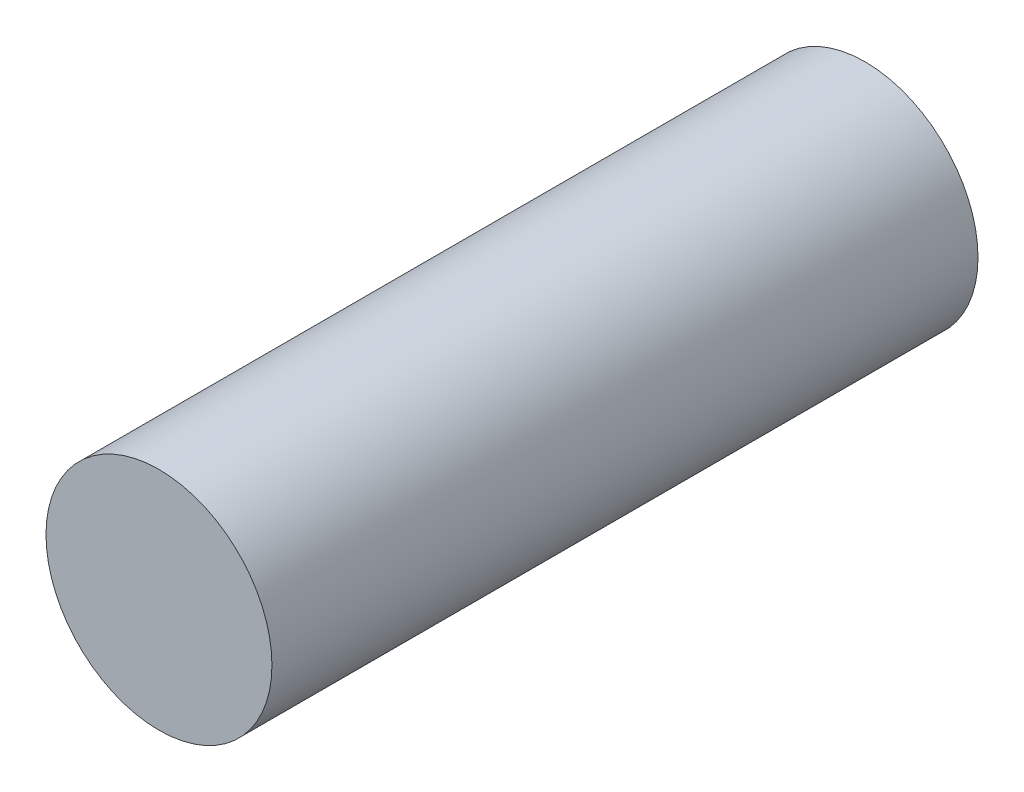
ISO-10303-21;
HEADER;
FILE_DESCRIPTION(('STEP AP214'),'2;1');
FILE_NAME('part.step','',(''),(''),'','','');
FILE_SCHEMA(('AUTOMOTIVE_DESIGN { 1 0 10303 214 1 1 1 1 }'));
ENDSEC;
DATA;
#1=APPLICATION_CONTEXT('core data for automotive mechanical design processes');
#2=APPLICATION_PROTOCOL_DEFINITION('international standard','automotive_design',2000,#1);
#3=PRODUCT_CONTEXT('',#1,'mechanical');
#4=PRODUCT('Part','Part','',(#3));
#5=PRODUCT_RELATED_PRODUCT_CATEGORY('part','',(#4));
#6=PRODUCT_DEFINITION_FORMATION('','',#4);
#7=PRODUCT_DEFINITION_CONTEXT('part definition',#1,'design');
#8=PRODUCT_DEFINITION('design','',#6,#7);
#9=PRODUCT_DEFINITION_SHAPE('','',#8);
#10=(LENGTH_UNIT() NAMED_UNIT(*) SI_UNIT(.MILLI.,.METRE.));
#11=(NAMED_UNIT(*) PLANE_ANGLE_UNIT() SI_UNIT($,.RADIAN.));
#12=(NAMED_UNIT(*) SI_UNIT($,.STERADIAN.) SOLID_ANGLE_UNIT());
#13=UNCERTAINTY_MEASURE_WITH_UNIT(LENGTH_MEASURE(1.E-05),#10,'distance_accuracy_value','');
#14=(GEOMETRIC_REPRESENTATION_CONTEXT(3) GLOBAL_UNCERTAINTY_ASSIGNED_CONTEXT((#13)) GLOBAL_UNIT_ASSIGNED_CONTEXT((#10,
#11,#12)) REPRESENTATION_CONTEXT('',''));
#15=CARTESIAN_POINT('',(0.,0.,0.));
#16=DIRECTION('',(0.,0.,1.));
#17=DIRECTION('',(1.,0.,0.));
#18=AXIS2_PLACEMENT_3D('',#15,#16,#17);
#19=CARTESIAN_POINT('',(0.,0.,25.));
#20=DIRECTION('',(0.,0.,-1.));
#21=DIRECTION('',(-1.,0.,0.));
#22=AXIS2_PLACEMENT_3D('',#19,#20,#21);
#23=CYLINDRICAL_SURFACE('',#22,4.);
#24=CARTESIAN_POINT('',(0.,0.,25.));
#25=DIRECTION('',(0.,0.,1.));
#26=DIRECTION('',(1.,0.,0.));
#27=AXIS2_PLACEMENT_3D('',#24,#25,#26);
#28=CIRCLE('',#27,4.);
#29=CARTESIAN_POINT('',(4.,0.,25.));
#30=VERTEX_POINT('',#29);
#31=EDGE_CURVE('E10',#30,#30,#28,.T.);
#32=ORIENTED_EDGE('',*,*,#31,.F.);
#33=EDGE_LOOP('',(#32));
#34=FACE_BOUND('',#33,.T.);
#35=CARTESIAN_POINT('',(0.,0.,0.));
#36=DIRECTION('',(0.,0.,1.));
#37=DIRECTION('',(1.,0.,0.));
#38=AXIS2_PLACEMENT_3D('',#35,#36,#37);
#39=CIRCLE('',#38,4.);
#40=CARTESIAN_POINT('',(4.,0.,0.));
#41=VERTEX_POINT('',#40);
#42=EDGE_CURVE('E35',#41,#41,#39,.T.);
#43=ORIENTED_EDGE('',*,*,#42,.T.);
#44=EDGE_LOOP('',(#43));
#45=FACE_BOUND('',#44,.T.);
#46=ADVANCED_FACE('F32',(#34,#45),#23,.T.);
#47=CARTESIAN_POINT('',(0.,0.,25.));
#48=DIRECTION('',(0.,0.,1.));
#49=DIRECTION('',(1.,0.,0.));
#50=AXIS2_PLACEMENT_3D('',#47,#48,#49);
#51=PLANE('',#50);
#52=ORIENTED_EDGE('',*,*,#31,.T.);
#53=EDGE_LOOP('',(#52));
#54=FACE_BOUND('',#53,.T.);
#55=ADVANCED_FACE('F47',(#54),#51,.T.);
#56=CARTESIAN_POINT('',(0.,0.,0.));
#57=DIRECTION('',(0.,0.,1.));
#58=DIRECTION('',(1.,0.,0.));
#59=AXIS2_PLACEMENT_3D('',#56,#57,#58);
#60=PLANE('',#59);
#61=ORIENTED_EDGE('',*,*,#42,.F.);
#62=EDGE_LOOP('',(#61));
#63=FACE_BOUND('',#62,.T.);
#64=ADVANCED_FACE('F45',(#63),#60,.F.);
#65=CLOSED_SHELL('',(#46,#55,#64));
#66=MANIFOLD_SOLID_BREP('B2',#65);
#67=ADVANCED_BREP_SHAPE_REPRESENTATION('',(#18,#66),#14);
#68=SHAPE_DEFINITION_REPRESENTATION(#9,#67);
ENDSEC;
END-ISO-10303-21;
